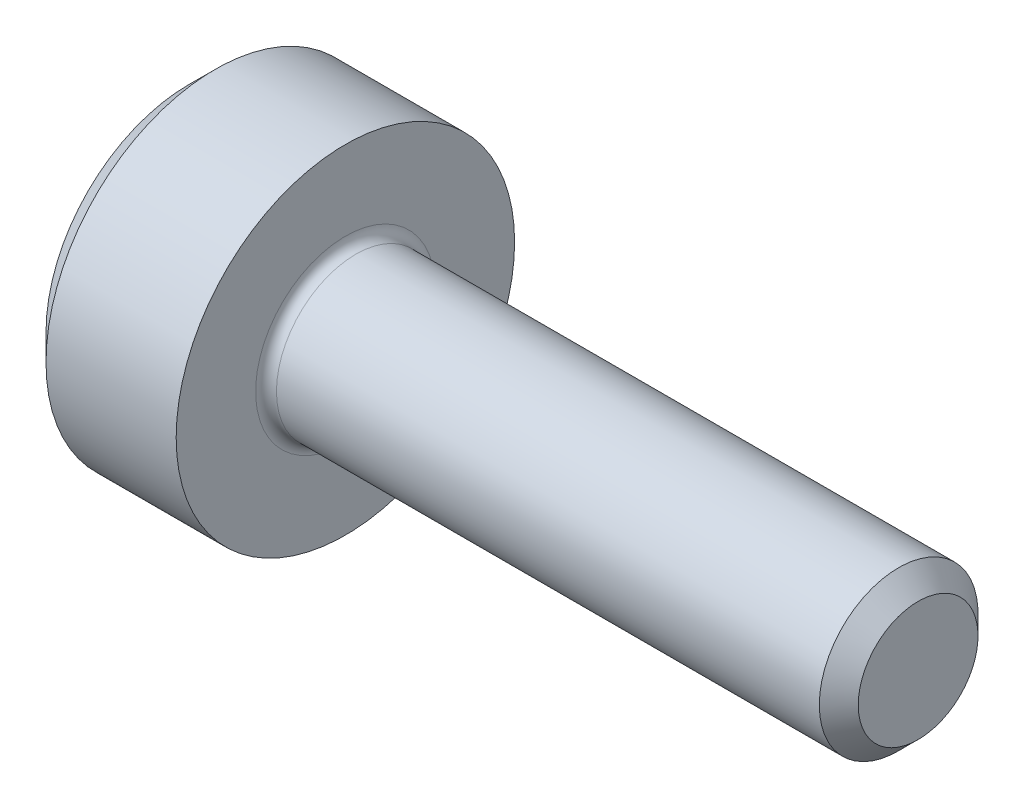
ISO-10303-21;
HEADER;
FILE_DESCRIPTION(('STEP AP214'),'2;1');
FILE_NAME('part.step','',(''),(''),'','','');
FILE_SCHEMA(('AUTOMOTIVE_DESIGN { 1 0 10303 214 1 1 1 1 }'));
ENDSEC;
DATA;
#1=APPLICATION_CONTEXT('core data for automotive mechanical design processes');
#2=APPLICATION_PROTOCOL_DEFINITION('international standard','automotive_design',2000,#1);
#3=PRODUCT_CONTEXT('',#1,'mechanical');
#4=PRODUCT('Part','Part','',(#3));
#5=PRODUCT_RELATED_PRODUCT_CATEGORY('part','',(#4));
#6=PRODUCT_DEFINITION_FORMATION('','',#4);
#7=PRODUCT_DEFINITION_CONTEXT('part definition',#1,'design');
#8=PRODUCT_DEFINITION('design','',#6,#7);
#9=PRODUCT_DEFINITION_SHAPE('','',#8);
#10=(LENGTH_UNIT() NAMED_UNIT(*) SI_UNIT(.MILLI.,.METRE.));
#11=(NAMED_UNIT(*) PLANE_ANGLE_UNIT() SI_UNIT($,.RADIAN.));
#12=(NAMED_UNIT(*) SI_UNIT($,.STERADIAN.) SOLID_ANGLE_UNIT());
#13=UNCERTAINTY_MEASURE_WITH_UNIT(LENGTH_MEASURE(1.E-05),#10,'distance_accuracy_value','');
#14=(GEOMETRIC_REPRESENTATION_CONTEXT(3) GLOBAL_UNCERTAINTY_ASSIGNED_CONTEXT((#13)) GLOBAL_UNIT_ASSIGNED_CONTEXT((#10,
#11,#12)) REPRESENTATION_CONTEXT('',''));
#15=CARTESIAN_POINT('',(0.,0.,0.));
#16=DIRECTION('',(0.,0.,1.));
#17=DIRECTION('',(1.,0.,0.));
#18=AXIS2_PLACEMENT_3D('',#15,#16,#17);
#19=CARTESIAN_POINT('',(0.,0.,0.));
#20=DIRECTION('',(-1.,0.,0.));
#21=DIRECTION('',(0.,0.,1.));
#22=AXIS2_PLACEMENT_3D('',#19,#20,#21);
#23=PLANE('',#22);
#24=DIRECTION('',(0.,-0.5,0.866025403784439));
#25=VECTOR('',#24,1.);
#26=CARTESIAN_POINT('',(0.,1.8475208614068,0.));
#27=LINE('',#26,#25);
#28=CARTESIAN_POINT('',(0.,1.8475208614068,0.));
#29=VERTEX_POINT('',#28);
#30=CARTESIAN_POINT('',(0.,0.9237604307034,1.6));
#31=VERTEX_POINT('',#30);
#32=EDGE_CURVE('E391',#29,#31,#27,.T.);
#33=ORIENTED_EDGE('',*,*,#32,.T.);
#34=DIRECTION('',(0.,1.,0.));
#35=VECTOR('',#34,1.);
#36=CARTESIAN_POINT('',(0.,-0.923760430703403,1.6));
#37=LINE('',#36,#35);
#38=CARTESIAN_POINT('',(0.,-0.923760430703403,1.6));
#39=VERTEX_POINT('',#38);
#40=EDGE_CURVE('E133',#39,#31,#37,.T.);
#41=ORIENTED_EDGE('',*,*,#40,.F.);
#42=DIRECTION('',(0.,-0.500000000000001,-0.866025403784438));
#43=VECTOR('',#42,1.);
#44=CARTESIAN_POINT('',(0.,-0.923760430703403,1.6));
#45=LINE('',#44,#43);
#46=CARTESIAN_POINT('',(0.,-1.84752086140681,0.));
#47=VERTEX_POINT('',#46);
#48=EDGE_CURVE('E394',#39,#47,#45,.T.);
#49=ORIENTED_EDGE('',*,*,#48,.T.);
#50=DIRECTION('',(0.,0.5,-0.866025403784439));
#51=VECTOR('',#50,1.);
#52=CARTESIAN_POINT('',(0.,-1.84752086140681,0.));
#53=LINE('',#52,#51);
#54=CARTESIAN_POINT('',(0.,-0.923760430703406,-1.6));
#55=VERTEX_POINT('',#54);
#56=EDGE_CURVE('E397',#47,#55,#53,.T.);
#57=ORIENTED_EDGE('',*,*,#56,.T.);
#58=DIRECTION('',(0.,-1.,0.));
#59=VECTOR('',#58,1.);
#60=CARTESIAN_POINT('',(0.,0.923760430703397,-1.6));
#61=LINE('',#60,#59);
#62=CARTESIAN_POINT('',(0.,0.923760430703397,-1.6));
#63=VERTEX_POINT('',#62);
#64=EDGE_CURVE('E400',#63,#55,#61,.T.);
#65=ORIENTED_EDGE('',*,*,#64,.F.);
#66=DIRECTION('',(0.,-0.500000000000001,-0.866025403784438));
#67=VECTOR('',#66,1.);
#68=CARTESIAN_POINT('',(0.,1.8475208614068,0.));
#69=LINE('',#68,#67);
#70=EDGE_CURVE('E128',#29,#63,#69,.T.);
#71=ORIENTED_EDGE('',*,*,#70,.F.);
#72=EDGE_LOOP('',(#33,#41,#49,#57,#65,#71));
#73=FACE_BOUND('',#72,.T.);
#74=CARTESIAN_POINT('',(0.,0.,0.));
#75=DIRECTION('',(-1.,0.,0.));
#76=DIRECTION('',(0.,0.,1.));
#77=AXIS2_PLACEMENT_3D('',#74,#75,#76);
#78=CIRCLE('',#77,2.75);
#79=CARTESIAN_POINT('',(0.,0.,2.75));
#80=VERTEX_POINT('',#79);
#81=EDGE_CURVE('E144',#80,#80,#78,.T.);
#82=ORIENTED_EDGE('',*,*,#81,.T.);
#83=EDGE_LOOP('',(#82));
#84=FACE_BOUND('',#83,.T.);
#85=ADVANCED_FACE('F37',(#73,#84),#23,.T.);
#86=CARTESIAN_POINT('',(14.,1.15,0.));
#87=DIRECTION('',(1.,0.,0.));
#88=DIRECTION('',(0.,0.,-1.));
#89=AXIS2_PLACEMENT_3D('',#86,#87,#88);
#90=PLANE('',#89);
#91=CARTESIAN_POINT('',(14.,0.,0.));
#92=DIRECTION('',(-1.,0.,0.));
#93=DIRECTION('',(0.,0.,1.));
#94=AXIS2_PLACEMENT_3D('',#91,#92,#93);
#95=CIRCLE('',#94,1.15);
#96=CARTESIAN_POINT('',(14.,0.,1.15));
#97=VERTEX_POINT('',#96);
#98=EDGE_CURVE('E157',#97,#97,#95,.T.);
#99=ORIENTED_EDGE('',*,*,#98,.F.);
#100=EDGE_LOOP('',(#99));
#101=FACE_BOUND('',#100,.T.);
#102=ADVANCED_FACE('F178',(#101),#90,.T.);
#103=CARTESIAN_POINT('',(14.,0.,0.));
#104=DIRECTION('',(-1.,0.,0.));
#105=DIRECTION('',(0.,0.,1.));
#106=AXIS2_PLACEMENT_3D('',#103,#104,#105);
#107=CONICAL_SURFACE('',#106,1.15,0.785398163397286);
#108=CARTESIAN_POINT('',(13.6259999999999,0.,0.));
#109=DIRECTION('',(-1.,0.,0.));
#110=DIRECTION('',(0.,0.,1.));
#111=AXIS2_PLACEMENT_3D('',#108,#109,#110);
#112=CIRCLE('',#111,1.52399999999993);
#113=CARTESIAN_POINT('',(13.6259999999999,0.,1.52399999999993));
#114=VERTEX_POINT('',#113);
#115=EDGE_CURVE('E154',#114,#114,#112,.T.);
#116=ORIENTED_EDGE('',*,*,#115,.F.);
#117=EDGE_LOOP('',(#116));
#118=FACE_BOUND('',#117,.T.);
#119=ORIENTED_EDGE('',*,*,#98,.T.);
#120=EDGE_LOOP('',(#119));
#121=FACE_BOUND('',#120,.T.);
#122=ADVANCED_FACE('F184',(#118,#121),#107,.T.);
#123=CARTESIAN_POINT('',(-31.75,0.,0.));
#124=DIRECTION('',(-1.,0.,0.));
#125=DIRECTION('',(0.,0.,1.));
#126=AXIS2_PLACEMENT_3D('',#123,#124,#125);
#127=CYLINDRICAL_SURFACE('',#126,1.52399999999994);
#128=CARTESIAN_POINT('',(3.2,0.,0.));
#129=DIRECTION('',(1.,0.,0.));
#130=DIRECTION('',(0.,0.,-1.));
#131=AXIS2_PLACEMENT_3D('',#128,#129,#130);
#132=CIRCLE('',#131,1.52399999999994);
#133=CARTESIAN_POINT('',(3.2,0.,-1.52399999999994));
#134=VERTEX_POINT('',#133);
#135=EDGE_CURVE('E11',#134,#134,#132,.T.);
#136=ORIENTED_EDGE('',*,*,#135,.T.);
#137=EDGE_LOOP('',(#136));
#138=FACE_BOUND('',#137,.T.);
#139=ORIENTED_EDGE('',*,*,#115,.T.);
#140=EDGE_LOOP('',(#139));
#141=FACE_BOUND('',#140,.T.);
#142=ADVANCED_FACE('F195',(#138,#141),#127,.T.);
#143=CARTESIAN_POINT('',(3.,3.25,0.));
#144=DIRECTION('',(1.,0.,0.));
#145=DIRECTION('',(0.,0.,-1.));
#146=AXIS2_PLACEMENT_3D('',#143,#144,#145);
#147=PLANE('',#146);
#148=CARTESIAN_POINT('',(3.,0.,0.));
#149=DIRECTION('',(1.,0.,0.));
#150=DIRECTION('',(0.,0.,-1.));
#151=AXIS2_PLACEMENT_3D('',#148,#149,#150);
#152=CIRCLE('',#151,1.72399999999994);
#153=CARTESIAN_POINT('',(3.,0.,-1.72399999999994));
#154=VERTEX_POINT('',#153);
#155=EDGE_CURVE('E45',#154,#154,#152,.F.);
#156=ORIENTED_EDGE('',*,*,#155,.T.);
#157=EDGE_LOOP('',(#156));
#158=FACE_BOUND('',#157,.T.);
#159=CARTESIAN_POINT('',(3.,0.,0.));
#160=DIRECTION('',(-1.,0.,0.));
#161=DIRECTION('',(0.,0.,1.));
#162=AXIS2_PLACEMENT_3D('',#159,#160,#161);
#163=CIRCLE('',#162,3.25);
#164=CARTESIAN_POINT('',(3.,0.,3.25));
#165=VERTEX_POINT('',#164);
#166=EDGE_CURVE('E151',#165,#165,#163,.T.);
#167=ORIENTED_EDGE('',*,*,#166,.F.);
#168=EDGE_LOOP('',(#167));
#169=FACE_BOUND('',#168,.T.);
#170=ADVANCED_FACE('F162',(#158,#169),#147,.T.);
#171=CARTESIAN_POINT('',(-31.75,0.,0.));
#172=DIRECTION('',(-1.,0.,0.));
#173=DIRECTION('',(0.,0.,1.));
#174=AXIS2_PLACEMENT_3D('',#171,#172,#173);
#175=CYLINDRICAL_SURFACE('',#174,3.25);
#176=ORIENTED_EDGE('',*,*,#166,.T.);
#177=EDGE_LOOP('',(#176));
#178=FACE_BOUND('',#177,.T.);
#179=CARTESIAN_POINT('',(0.5,0.,0.));
#180=DIRECTION('',(-1.,0.,0.));
#181=DIRECTION('',(0.,0.,1.));
#182=AXIS2_PLACEMENT_3D('',#179,#180,#181);
#183=CIRCLE('',#182,3.25);
#184=CARTESIAN_POINT('',(0.5,0.,3.25));
#185=VERTEX_POINT('',#184);
#186=EDGE_CURVE('E148',#185,#185,#183,.T.);
#187=ORIENTED_EDGE('',*,*,#186,.F.);
#188=EDGE_LOOP('',(#187));
#189=FACE_BOUND('',#188,.T.);
#190=ADVANCED_FACE('F173',(#178,#189),#175,.T.);
#191=CARTESIAN_POINT('',(0.,0.,0.));
#192=DIRECTION('',(1.,0.,0.));
#193=DIRECTION('',(0.,0.,-1.));
#194=AXIS2_PLACEMENT_3D('',#191,#192,#193);
#195=CONICAL_SURFACE('',#194,2.75,0.785398163397448);
#196=ORIENTED_EDGE('',*,*,#186,.T.);
#197=EDGE_LOOP('',(#196));
#198=FACE_BOUND('',#197,.T.);
#199=ORIENTED_EDGE('',*,*,#81,.F.);
#200=EDGE_LOOP('',(#199));
#201=FACE_BOUND('',#200,.T.);
#202=ADVANCED_FACE('F166',(#198,#201),#195,.T.);
#203=CARTESIAN_POINT('',(3.2,0.,0.));
#204=DIRECTION('',(1.,0.,0.));
#205=DIRECTION('',(0.,0.,-1.));
#206=AXIS2_PLACEMENT_3D('',#203,#204,#205);
#207=TOROIDAL_SURFACE('',#206,1.72399999999994,0.2);
#208=ORIENTED_EDGE('',*,*,#135,.F.);
#209=EDGE_LOOP('',(#208));
#210=FACE_BOUND('',#209,.T.);
#211=ORIENTED_EDGE('',*,*,#155,.F.);
#212=EDGE_LOOP('',(#211));
#213=FACE_BOUND('',#212,.T.);
#214=ADVANCED_FACE('F39',(#210,#213),#207,.F.);
#215=CARTESIAN_POINT('',(2.5,1.8475208614068,0.));
#216=DIRECTION('',(0.,-0.866025403784439,-0.5));
#217=DIRECTION('',(0.,0.5,-0.866025403784439));
#218=AXIS2_PLACEMENT_3D('',#215,#216,#217);
#219=PLANE('',#218);
#220=ORIENTED_EDGE('',*,*,#32,.F.);
#221=DIRECTION('',(-1.,0.,0.));
#222=VECTOR('',#221,1.);
#223=CARTESIAN_POINT('',(2.5,1.8475208614068,0.));
#224=LINE('',#223,#222);
#225=CARTESIAN_POINT('',(2.5,1.8475208614068,0.));
#226=VERTEX_POINT('',#225);
#227=EDGE_CURVE('E381',#226,#29,#224,.T.);
#228=ORIENTED_EDGE('',*,*,#227,.F.);
#229=DIRECTION('',(0.,-0.5,0.866025403784439));
#230=VECTOR('',#229,1.);
#231=CARTESIAN_POINT('',(2.5,1.8475208614068,0.));
#232=LINE('',#231,#230);
#233=CARTESIAN_POINT('',(2.5,1.3856406460551,0.799999999999998));
#234=VERTEX_POINT('',#233);
#235=EDGE_CURVE('E120',#226,#234,#232,.T.);
#236=ORIENTED_EDGE('',*,*,#235,.T.);
#237=CARTESIAN_POINT('',(2.5,0.9237604307034,1.6));
#238=VERTEX_POINT('',#237);
#239=EDGE_CURVE('E111',#234,#238,#232,.T.);
#240=ORIENTED_EDGE('',*,*,#239,.T.);
#241=DIRECTION('',(-1.,0.,0.));
#242=VECTOR('',#241,1.);
#243=CARTESIAN_POINT('',(2.5,0.9237604307034,1.6));
#244=LINE('',#243,#242);
#245=EDGE_CURVE('E125',#238,#31,#244,.T.);
#246=ORIENTED_EDGE('',*,*,#245,.T.);
#247=EDGE_LOOP('',(#220,#228,#236,#240,#246));
#248=FACE_BOUND('',#247,.T.);
#249=ADVANCED_FACE('F124',(#248),#219,.T.);
#250=CARTESIAN_POINT('',(2.5,-0.923760430703403,1.6));
#251=DIRECTION('',(0.,0.,1.));
#252=DIRECTION('',(0.,-1.,0.));
#253=AXIS2_PLACEMENT_3D('',#250,#251,#252);
#254=PLANE('',#253);
#255=ORIENTED_EDGE('',*,*,#40,.T.);
#256=ORIENTED_EDGE('',*,*,#245,.F.);
#257=DIRECTION('',(0.,1.,0.));
#258=VECTOR('',#257,1.);
#259=CARTESIAN_POINT('',(2.5,-0.923760430703403,1.6));
#260=LINE('',#259,#258);
#261=CARTESIAN_POINT('',(2.5,0.,1.6));
#262=VERTEX_POINT('',#261);
#263=EDGE_CURVE('E108',#262,#238,#260,.T.);
#264=ORIENTED_EDGE('',*,*,#263,.F.);
#265=CARTESIAN_POINT('',(2.5,-0.923760430703403,1.6));
#266=VERTEX_POINT('',#265);
#267=EDGE_CURVE('E119',#266,#262,#260,.T.);
#268=ORIENTED_EDGE('',*,*,#267,.F.);
#269=DIRECTION('',(-1.,0.,0.));
#270=VECTOR('',#269,1.);
#271=CARTESIAN_POINT('',(2.5,-0.923760430703403,1.6));
#272=LINE('',#271,#270);
#273=EDGE_CURVE('E135',#266,#39,#272,.T.);
#274=ORIENTED_EDGE('',*,*,#273,.T.);
#275=EDGE_LOOP('',(#255,#256,#264,#268,#274));
#276=FACE_BOUND('',#275,.T.);
#277=ADVANCED_FACE('F130',(#276),#254,.F.);
#278=CARTESIAN_POINT('',(2.5,-0.923760430703403,1.6));
#279=DIRECTION('',(0.,0.866025403784438,-0.500000000000001));
#280=DIRECTION('',(0.,0.500000000000001,0.866025403784438));
#281=AXIS2_PLACEMENT_3D('',#278,#279,#280);
#282=PLANE('',#281);
#283=ORIENTED_EDGE('',*,*,#48,.F.);
#284=ORIENTED_EDGE('',*,*,#273,.F.);
#285=DIRECTION('',(0.,-0.500000000000001,-0.866025403784438));
#286=VECTOR('',#285,1.);
#287=CARTESIAN_POINT('',(2.5,-0.923760430703403,1.6));
#288=LINE('',#287,#286);
#289=CARTESIAN_POINT('',(2.5,-1.3856406460551,0.800000000000003));
#290=VERTEX_POINT('',#289);
#291=EDGE_CURVE('E420',#266,#290,#288,.T.);
#292=ORIENTED_EDGE('',*,*,#291,.T.);
#293=CARTESIAN_POINT('',(2.5,-1.84752086140681,0.));
#294=VERTEX_POINT('',#293);
#295=EDGE_CURVE('E409',#290,#294,#288,.T.);
#296=ORIENTED_EDGE('',*,*,#295,.T.);
#297=DIRECTION('',(-1.,0.,0.));
#298=VECTOR('',#297,1.);
#299=CARTESIAN_POINT('',(2.5,-1.84752086140681,0.));
#300=LINE('',#299,#298);
#301=EDGE_CURVE('E140',#294,#47,#300,.T.);
#302=ORIENTED_EDGE('',*,*,#301,.T.);
#303=EDGE_LOOP('',(#283,#284,#292,#296,#302));
#304=FACE_BOUND('',#303,.T.);
#305=ADVANCED_FACE('F272',(#304),#282,.T.);
#306=CARTESIAN_POINT('',(2.5,-1.84752086140681,0.));
#307=DIRECTION('',(0.,0.866025403784439,0.5));
#308=DIRECTION('',(0.,-0.5,0.866025403784439));
#309=AXIS2_PLACEMENT_3D('',#306,#307,#308);
#310=PLANE('',#309);
#311=ORIENTED_EDGE('',*,*,#56,.F.);
#312=ORIENTED_EDGE('',*,*,#301,.F.);
#313=DIRECTION('',(0.,0.5,-0.866025403784439));
#314=VECTOR('',#313,1.);
#315=CARTESIAN_POINT('',(2.5,-1.84752086140681,0.));
#316=LINE('',#315,#314);
#317=CARTESIAN_POINT('',(2.5,-1.38564064605511,-0.800000000000001));
#318=VERTEX_POINT('',#317);
#319=EDGE_CURVE('E387',#294,#318,#316,.T.);
#320=ORIENTED_EDGE('',*,*,#319,.T.);
#321=CARTESIAN_POINT('',(2.5,-0.923760430703406,-1.6));
#322=VERTEX_POINT('',#321);
#323=EDGE_CURVE('E419',#318,#322,#316,.T.);
#324=ORIENTED_EDGE('',*,*,#323,.T.);
#325=DIRECTION('',(-1.,0.,0.));
#326=VECTOR('',#325,1.);
#327=CARTESIAN_POINT('',(2.5,-0.923760430703406,-1.6));
#328=LINE('',#327,#326);
#329=EDGE_CURVE('E380',#322,#55,#328,.T.);
#330=ORIENTED_EDGE('',*,*,#329,.T.);
#331=EDGE_LOOP('',(#311,#312,#320,#324,#330));
#332=FACE_BOUND('',#331,.T.);
#333=ADVANCED_FACE('F280',(#332),#310,.T.);
#334=CARTESIAN_POINT('',(2.5,0.923760430703397,-1.6));
#335=DIRECTION('',(0.,0.,-1.));
#336=DIRECTION('',(0.,1.,0.));
#337=AXIS2_PLACEMENT_3D('',#334,#335,#336);
#338=PLANE('',#337);
#339=ORIENTED_EDGE('',*,*,#64,.T.);
#340=ORIENTED_EDGE('',*,*,#329,.F.);
#341=DIRECTION('',(0.,-1.,0.));
#342=VECTOR('',#341,1.);
#343=CARTESIAN_POINT('',(2.5,0.923760430703397,-1.6));
#344=LINE('',#343,#342);
#345=CARTESIAN_POINT('',(2.5,0.,-1.6));
#346=VERTEX_POINT('',#345);
#347=EDGE_CURVE('E384',#346,#322,#344,.T.);
#348=ORIENTED_EDGE('',*,*,#347,.F.);
#349=CARTESIAN_POINT('',(2.5,0.923760430703397,-1.6));
#350=VERTEX_POINT('',#349);
#351=EDGE_CURVE('E52',#350,#346,#344,.T.);
#352=ORIENTED_EDGE('',*,*,#351,.F.);
#353=DIRECTION('',(-1.,0.,0.));
#354=VECTOR('',#353,1.);
#355=CARTESIAN_POINT('',(2.5,0.923760430703397,-1.6));
#356=LINE('',#355,#354);
#357=EDGE_CURVE('E377',#350,#63,#356,.T.);
#358=ORIENTED_EDGE('',*,*,#357,.T.);
#359=EDGE_LOOP('',(#339,#340,#348,#352,#358));
#360=FACE_BOUND('',#359,.T.);
#361=ADVANCED_FACE('F289',(#360),#338,.F.);
#362=CARTESIAN_POINT('',(2.5,1.8475208614068,0.));
#363=DIRECTION('',(0.,0.866025403784438,-0.500000000000001));
#364=DIRECTION('',(0.,0.500000000000001,0.866025403784438));
#365=AXIS2_PLACEMENT_3D('',#362,#363,#364);
#366=PLANE('',#365);
#367=ORIENTED_EDGE('',*,*,#70,.T.);
#368=ORIENTED_EDGE('',*,*,#357,.F.);
#369=DIRECTION('',(0.,-0.500000000000001,-0.866025403784438));
#370=VECTOR('',#369,1.);
#371=CARTESIAN_POINT('',(2.5,1.8475208614068,0.));
#372=LINE('',#371,#370);
#373=CARTESIAN_POINT('',(2.5,1.3856406460551,-0.800000000000001));
#374=VERTEX_POINT('',#373);
#375=EDGE_CURVE('E367',#374,#350,#372,.T.);
#376=ORIENTED_EDGE('',*,*,#375,.F.);
#377=EDGE_CURVE('E373',#226,#374,#372,.T.);
#378=ORIENTED_EDGE('',*,*,#377,.F.);
#379=ORIENTED_EDGE('',*,*,#227,.T.);
#380=EDGE_LOOP('',(#367,#368,#376,#378,#379));
#381=FACE_BOUND('',#380,.T.);
#382=ADVANCED_FACE('F298',(#381),#366,.F.);
#383=CARTESIAN_POINT('',(2.5,1.8475208614068,0.));
#384=DIRECTION('',(1.,0.,0.));
#385=DIRECTION('',(0.,0.,-1.));
#386=AXIS2_PLACEMENT_3D('',#383,#384,#385);
#387=PLANE('',#386);
#388=ORIENTED_EDGE('',*,*,#347,.T.);
#389=ORIENTED_EDGE('',*,*,#323,.F.);
#390=CARTESIAN_POINT('',(2.5,0.,0.));
#391=DIRECTION('',(-1.,0.,0.));
#392=DIRECTION('',(0.,0.,1.));
#393=AXIS2_PLACEMENT_3D('',#390,#391,#392);
#394=CIRCLE('',#393,1.6);
#395=EDGE_CURVE('E415',#346,#318,#394,.T.);
#396=ORIENTED_EDGE('',*,*,#395,.F.);
#397=EDGE_LOOP('',(#388,#389,#396));
#398=FACE_BOUND('',#397,.T.);
#399=ADVANCED_FACE('F307',(#398),#387,.F.);
#400=ORIENTED_EDGE('',*,*,#319,.F.);
#401=ORIENTED_EDGE('',*,*,#295,.F.);
#402=EDGE_CURVE('E138',#318,#290,#394,.T.);
#403=ORIENTED_EDGE('',*,*,#402,.F.);
#404=EDGE_LOOP('',(#400,#401,#403));
#405=FACE_BOUND('',#404,.T.);
#406=ADVANCED_FACE('F316',(#405),#387,.F.);
#407=ORIENTED_EDGE('',*,*,#291,.F.);
#408=ORIENTED_EDGE('',*,*,#267,.T.);
#409=EDGE_CURVE('E134',#290,#262,#394,.T.);
#410=ORIENTED_EDGE('',*,*,#409,.F.);
#411=EDGE_LOOP('',(#407,#408,#410));
#412=FACE_BOUND('',#411,.T.);
#413=ADVANCED_FACE('F325',(#412),#387,.F.);
#414=ORIENTED_EDGE('',*,*,#263,.T.);
#415=ORIENTED_EDGE('',*,*,#239,.F.);
#416=EDGE_CURVE('E114',#262,#234,#394,.T.);
#417=ORIENTED_EDGE('',*,*,#416,.F.);
#418=EDGE_LOOP('',(#414,#415,#417));
#419=FACE_BOUND('',#418,.T.);
#420=ADVANCED_FACE('F110',(#419),#387,.F.);
#421=ORIENTED_EDGE('',*,*,#235,.F.);
#422=ORIENTED_EDGE('',*,*,#377,.T.);
#423=EDGE_CURVE('E145',#234,#374,#394,.T.);
#424=ORIENTED_EDGE('',*,*,#423,.F.);
#425=EDGE_LOOP('',(#421,#422,#424));
#426=FACE_BOUND('',#425,.T.);
#427=ADVANCED_FACE('F340',(#426),#387,.F.);
#428=ORIENTED_EDGE('',*,*,#375,.T.);
#429=ORIENTED_EDGE('',*,*,#351,.T.);
#430=EDGE_CURVE('E370',#374,#346,#394,.T.);
#431=ORIENTED_EDGE('',*,*,#430,.F.);
#432=EDGE_LOOP('',(#428,#429,#431));
#433=FACE_BOUND('',#432,.T.);
#434=ADVANCED_FACE('F255',(#433),#387,.F.);
#435=CARTESIAN_POINT('',(2.5,0.,0.));
#436=DIRECTION('',(-1.,0.,0.));
#437=DIRECTION('',(0.,0.,1.));
#438=AXIS2_PLACEMENT_3D('',#435,#436,#437);
#439=CONICAL_SURFACE('',#438,1.6,1.04719755119659);
#440=CARTESIAN_POINT('',(3.42376043070342,0.,0.));
#441=VERTEX_POINT('',#440);
#442=VERTEX_LOOP('',#441);
#443=FACE_BOUND('',#442,.T.);
#444=ORIENTED_EDGE('',*,*,#416,.T.);
#445=ORIENTED_EDGE('',*,*,#423,.T.);
#446=ORIENTED_EDGE('',*,*,#430,.T.);
#447=ORIENTED_EDGE('',*,*,#395,.T.);
#448=ORIENTED_EDGE('',*,*,#402,.T.);
#449=ORIENTED_EDGE('',*,*,#409,.T.);
#450=EDGE_LOOP('',(#444,#445,#446,#447,#448,#449));
#451=FACE_BOUND('',#450,.T.);
#452=ADVANCED_FACE('F188',(#443,#451),#439,.F.);
#453=CLOSED_SHELL('',(#85,#102,#122,#142,#170,#190,#202,#214,#249,#277,#305,#333,#361,#382,#399,
#406,#413,#420,#427,#434,#452));
#454=MANIFOLD_SOLID_BREP('B2',#453);
#455=ADVANCED_BREP_SHAPE_REPRESENTATION('',(#18,#454),#14);
#456=SHAPE_DEFINITION_REPRESENTATION(#9,#455);
ENDSEC;
END-ISO-10303-21;
